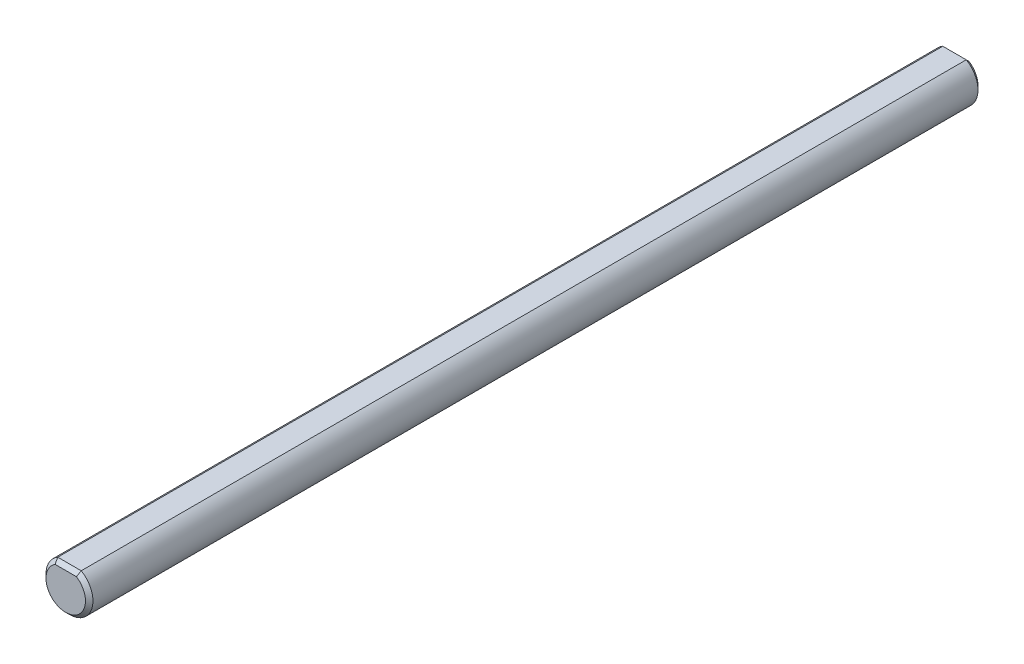
ISO-10303-21;
HEADER;
FILE_DESCRIPTION(('STEP AP214'),'2;1');
FILE_NAME('part.step','',(''),(''),'','','');
FILE_SCHEMA(('AUTOMOTIVE_DESIGN { 1 0 10303 214 1 1 1 1 }'));
ENDSEC;
DATA;
#1=APPLICATION_CONTEXT('core data for automotive mechanical design processes');
#2=APPLICATION_PROTOCOL_DEFINITION('international standard','automotive_design',2000,#1);
#3=PRODUCT_CONTEXT('',#1,'mechanical');
#4=PRODUCT('Part','Part','',(#3));
#5=PRODUCT_RELATED_PRODUCT_CATEGORY('part','',(#4));
#6=PRODUCT_DEFINITION_FORMATION('','',#4);
#7=PRODUCT_DEFINITION_CONTEXT('part definition',#1,'design');
#8=PRODUCT_DEFINITION('design','',#6,#7);
#9=PRODUCT_DEFINITION_SHAPE('','',#8);
#10=(LENGTH_UNIT() NAMED_UNIT(*) SI_UNIT(.MILLI.,.METRE.));
#11=(NAMED_UNIT(*) PLANE_ANGLE_UNIT() SI_UNIT($,.RADIAN.));
#12=(NAMED_UNIT(*) SI_UNIT($,.STERADIAN.) SOLID_ANGLE_UNIT());
#13=UNCERTAINTY_MEASURE_WITH_UNIT(LENGTH_MEASURE(1.E-05),#10,'distance_accuracy_value','');
#14=(GEOMETRIC_REPRESENTATION_CONTEXT(3) GLOBAL_UNCERTAINTY_ASSIGNED_CONTEXT((#13)) GLOBAL_UNIT_ASSIGNED_CONTEXT((#10,
#11,#12)) REPRESENTATION_CONTEXT('',''));
#15=CARTESIAN_POINT('',(0.,0.,0.));
#16=DIRECTION('',(0.,0.,1.));
#17=DIRECTION('',(1.,0.,0.));
#18=AXIS2_PLACEMENT_3D('',#15,#16,#17);
#19=CARTESIAN_POINT('',(0.,0.,120.65));
#20=DIRECTION('',(0.,0.,-1.));
#21=DIRECTION('',(-1.,0.,0.));
#22=AXIS2_PLACEMENT_3D('',#19,#20,#21);
#23=CYLINDRICAL_SURFACE('',#22,3.175);
#24=DIRECTION('',(0.,0.,-1.));
#25=VECTOR('',#24,1.);
#26=CARTESIAN_POINT('',(1.5875,2.74963065701559,120.65));
#27=LINE('',#26,#25);
#28=CARTESIAN_POINT('',(1.5875,2.74963065701559,120.142));
#29=VERTEX_POINT('',#28);
#30=CARTESIAN_POINT('',(1.5875,2.74963065701559,0.508000000000119));
#31=VERTEX_POINT('',#30);
#32=EDGE_CURVE('E100',#29,#31,#27,.T.);
#33=ORIENTED_EDGE('',*,*,#32,.F.);
#34=CARTESIAN_POINT('',(0.,0.,120.142));
#35=DIRECTION('',(0.,0.,1.));
#36=DIRECTION('',(1.,0.,0.));
#37=AXIS2_PLACEMENT_3D('',#34,#35,#36);
#38=CIRCLE('',#37,3.175);
#39=CARTESIAN_POINT('',(-1.5875,2.74963065701559,120.142));
#40=VERTEX_POINT('',#39);
#41=EDGE_CURVE('E112',#29,#40,#38,.F.);
#42=ORIENTED_EDGE('',*,*,#41,.T.);
#43=DIRECTION('',(0.,0.,-1.));
#44=VECTOR('',#43,1.);
#45=CARTESIAN_POINT('',(-1.5875,2.74963065701559,120.65));
#46=LINE('',#45,#44);
#47=CARTESIAN_POINT('',(-1.5875,2.74963065701559,0.508000000000119));
#48=VERTEX_POINT('',#47);
#49=EDGE_CURVE('E156',#40,#48,#46,.T.);
#50=ORIENTED_EDGE('',*,*,#49,.T.);
#51=CARTESIAN_POINT('',(0.,0.,0.508000000000092));
#52=DIRECTION('',(0.,0.,1.));
#53=DIRECTION('',(1.,0.,0.));
#54=AXIS2_PLACEMENT_3D('',#51,#52,#53);
#55=CIRCLE('',#54,3.175);
#56=EDGE_CURVE('E110',#48,#31,#55,.T.);
#57=ORIENTED_EDGE('',*,*,#56,.T.);
#58=EDGE_LOOP('',(#33,#42,#50,#57));
#59=FACE_BOUND('',#58,.T.);
#60=ADVANCED_FACE('F37',(#59),#23,.T.);
#61=CARTESIAN_POINT('',(-1.5875,2.74963065701559,120.65));
#62=DIRECTION('',(0.,-1.,0.));
#63=DIRECTION('',(0.,0.,-1.));
#64=AXIS2_PLACEMENT_3D('',#61,#62,#63);
#65=PLANE('',#64);
#66=ORIENTED_EDGE('',*,*,#49,.F.);
#67=DIRECTION('',(1.,0.,0.));
#68=VECTOR('',#67,1.);
#69=CARTESIAN_POINT('',(1.5875,2.74963065701559,120.142));
#70=LINE('',#69,#68);
#71=EDGE_CURVE('E91',#40,#29,#70,.T.);
#72=ORIENTED_EDGE('',*,*,#71,.T.);
#73=ORIENTED_EDGE('',*,*,#32,.T.);
#74=DIRECTION('',(-1.,0.,0.));
#75=VECTOR('',#74,1.);
#76=CARTESIAN_POINT('',(-1.5875,2.74963065701559,0.508000000000106));
#77=LINE('',#76,#75);
#78=EDGE_CURVE('E103',#31,#48,#77,.T.);
#79=ORIENTED_EDGE('',*,*,#78,.T.);
#80=EDGE_LOOP('',(#66,#72,#73,#79));
#81=FACE_BOUND('',#80,.T.);
#82=ADVANCED_FACE('F155',(#81),#65,.F.);
#83=CARTESIAN_POINT('',(0.,0.,120.65));
#84=DIRECTION('',(0.,0.,1.));
#85=DIRECTION('',(1.,0.,0.));
#86=AXIS2_PLACEMENT_3D('',#83,#84,#85);
#87=PLANE('',#86);
#88=CARTESIAN_POINT('',(0.,0.,120.65));
#89=DIRECTION('',(0.,0.,1.));
#90=DIRECTION('',(1.,0.,0.));
#91=AXIS2_PLACEMENT_3D('',#88,#89,#90);
#92=CIRCLE('',#91,2.66700000000007);
#93=CARTESIAN_POINT('',(-1.44498477415089,2.24163065701566,120.65));
#94=VERTEX_POINT('',#93);
#95=CARTESIAN_POINT('',(1.44498477415089,2.24163065701566,120.65));
#96=VERTEX_POINT('',#95);
#97=EDGE_CURVE('E97',#94,#96,#92,.T.);
#98=ORIENTED_EDGE('',*,*,#97,.T.);
#99=DIRECTION('',(-1.,0.,0.));
#100=VECTOR('',#99,1.);
#101=CARTESIAN_POINT('',(-1.5875,2.24163065701566,120.65));
#102=LINE('',#101,#100);
#103=EDGE_CURVE('E89',#96,#94,#102,.T.);
#104=ORIENTED_EDGE('',*,*,#103,.T.);
#105=EDGE_LOOP('',(#98,#104));
#106=FACE_BOUND('',#105,.T.);
#107=ADVANCED_FACE('F102',(#106),#87,.T.);
#108=CARTESIAN_POINT('',(0.,0.,0.));
#109=DIRECTION('',(0.,0.,1.));
#110=DIRECTION('',(1.,0.,0.));
#111=AXIS2_PLACEMENT_3D('',#108,#109,#110);
#112=PLANE('',#111);
#113=CARTESIAN_POINT('',(0.,0.,0.));
#114=DIRECTION('',(0.,0.,1.));
#115=DIRECTION('',(1.,0.,0.));
#116=AXIS2_PLACEMENT_3D('',#113,#114,#115);
#117=CIRCLE('',#116,2.66699999999991);
#118=CARTESIAN_POINT('',(1.44498477415084,2.2416306570155,0.));
#119=VERTEX_POINT('',#118);
#120=CARTESIAN_POINT('',(-1.44498477415084,2.2416306570155,0.));
#121=VERTEX_POINT('',#120);
#122=EDGE_CURVE('E52',#119,#121,#117,.F.);
#123=ORIENTED_EDGE('',*,*,#122,.T.);
#124=DIRECTION('',(1.,0.,0.));
#125=VECTOR('',#124,1.);
#126=CARTESIAN_POINT('',(0.,2.2416306570155,0.));
#127=LINE('',#126,#125);
#128=EDGE_CURVE('E11',#121,#119,#127,.T.);
#129=ORIENTED_EDGE('',*,*,#128,.T.);
#130=EDGE_LOOP('',(#123,#129));
#131=FACE_BOUND('',#130,.T.);
#132=ADVANCED_FACE('F164',(#131),#112,.F.);
#133=CARTESIAN_POINT('',(0.,0.,120.65));
#134=DIRECTION('',(0.,0.,-1.));
#135=DIRECTION('',(-1.,0.,0.));
#136=AXIS2_PLACEMENT_3D('',#133,#134,#135);
#137=CONICAL_SURFACE('',#136,2.66700000000007,0.785398163397438);
#138=CARTESIAN_POINT('',(-1.44498477415089,2.24163065701566,120.65));
#139=CARTESIAN_POINT('',(-1.46981082100592,2.32614689549515,120.565483761521));
#140=CARTESIAN_POINT('',(-1.49410013308599,2.41073842223696,120.480892234779));
#141=CARTESIAN_POINT('',(-1.54160520461425,2.58007175609696,120.311558900919));
#142=CARTESIAN_POINT('',(-1.56482096781721,2.66481356268845,120.226817094327));
#143=CARTESIAN_POINT('',(-1.5875,2.74963065701559,120.142));
#144=B_SPLINE_CURVE_WITH_KNOTS('',3,(#138,#139,#140,#141,#142,#143),.UNSPECIFIED.,.F.,.F.,(4,2,
4),(0.,0.366214160388582,0.732427039830156),.UNSPECIFIED.);
#145=EDGE_CURVE('E85',#40,#94,#144,.F.);
#146=ORIENTED_EDGE('',*,*,#145,.F.);
#147=ORIENTED_EDGE('',*,*,#41,.F.);
#148=CARTESIAN_POINT('',(1.5875,2.74963065701559,120.142));
#149=CARTESIAN_POINT('',(1.56482096781721,2.66481356268845,120.226817094327));
#150=CARTESIAN_POINT('',(1.54160520461425,2.58007175609696,120.311558900919));
#151=CARTESIAN_POINT('',(1.49410013308599,2.41073842223696,120.480892234779));
#152=CARTESIAN_POINT('',(1.46981082100592,2.32614689549514,120.56548376152));
#153=CARTESIAN_POINT('',(1.44498477415089,2.24163065701566,120.65));
#154=B_SPLINE_CURVE_WITH_KNOTS('',3,(#148,#149,#150,#151,#152,#153),.UNSPECIFIED.,.F.,.F.,(4,2,
4),(0.,0.366212879441566,0.732427039830159),.UNSPECIFIED.);
#155=EDGE_CURVE('E94',#96,#29,#154,.F.);
#156=ORIENTED_EDGE('',*,*,#155,.F.);
#157=ORIENTED_EDGE('',*,*,#97,.F.);
#158=EDGE_LOOP('',(#146,#147,#156,#157));
#159=FACE_BOUND('',#158,.T.);
#160=ADVANCED_FACE('F98',(#159),#137,.T.);
#161=CARTESIAN_POINT('',(0.,2.24163065701566,120.65));
#162=DIRECTION('',(0.,0.707106781186555,0.70710678118654));
#163=DIRECTION('',(1.,0.,0.));
#164=AXIS2_PLACEMENT_3D('',#161,#162,#163);
#165=PLANE('',#164);
#166=ORIENTED_EDGE('',*,*,#155,.T.);
#167=ORIENTED_EDGE('',*,*,#71,.F.);
#168=ORIENTED_EDGE('',*,*,#145,.T.);
#169=ORIENTED_EDGE('',*,*,#103,.F.);
#170=EDGE_LOOP('',(#166,#167,#168,#169));
#171=FACE_BOUND('',#170,.T.);
#172=ADVANCED_FACE('F87',(#171),#165,.T.);
#173=CARTESIAN_POINT('',(0.,0.,0.508000000000092));
#174=DIRECTION('',(0.,0.,1.));
#175=DIRECTION('',(1.,0.,0.));
#176=AXIS2_PLACEMENT_3D('',#173,#174,#175);
#177=CONICAL_SURFACE('',#176,3.175,0.785398163397451);
#178=CARTESIAN_POINT('',(-1.5875,2.74963065701559,0.508000000000119));
#179=CARTESIAN_POINT('',(-1.56482096781721,2.66481356268843,0.423182905672945));
#180=CARTESIAN_POINT('',(-1.54160520461425,2.58007175609691,0.338441099081421));
#181=CARTESIAN_POINT('',(-1.49410013308598,2.41073842223686,0.169107765221361));
#182=CARTESIAN_POINT('',(-1.46981082100589,2.32614689549501,0.084516238479512));
#183=CARTESIAN_POINT('',(-1.44498477415084,2.2416306570155,0.));
#184=B_SPLINE_CURVE_WITH_KNOTS('',3,(#178,#179,#180,#181,#182,#183),.UNSPECIFIED.,.F.,.F.,(4,2,
4),(0.,0.366212879441686,0.732427039830408),.UNSPECIFIED.);
#185=EDGE_CURVE('E142',#121,#48,#184,.F.);
#186=ORIENTED_EDGE('',*,*,#185,.F.);
#187=ORIENTED_EDGE('',*,*,#122,.F.);
#188=CARTESIAN_POINT('',(1.44498477415084,2.2416306570155,0.));
#189=CARTESIAN_POINT('',(1.46981082100589,2.32614689549501,0.0845162384795138));
#190=CARTESIAN_POINT('',(1.49410013308597,2.41073842223686,0.169107765221363));
#191=CARTESIAN_POINT('',(1.54160520461425,2.58007175609691,0.338441099081419));
#192=CARTESIAN_POINT('',(1.56482096781723,2.66481356268843,0.423182905672939));
#193=CARTESIAN_POINT('',(1.58750000000003,2.7496306570156,0.508000000000108));
#194=B_SPLINE_CURVE_WITH_KNOTS('',3,(#188,#189,#190,#191,#192,#193),.UNSPECIFIED.,.F.,.F.,(4,2,
4),(0.,0.366214160388722,0.732427039830408),.UNSPECIFIED.);
#195=EDGE_CURVE('E43',#31,#119,#194,.F.);
#196=ORIENTED_EDGE('',*,*,#195,.F.);
#197=ORIENTED_EDGE('',*,*,#56,.F.);
#198=EDGE_LOOP('',(#186,#187,#196,#197));
#199=FACE_BOUND('',#198,.T.);
#200=ADVANCED_FACE('F133',(#199),#177,.T.);
#201=CARTESIAN_POINT('',(-1.5875,2.74963065701559,0.508000000000106));
#202=DIRECTION('',(0.,-0.707106781186555,0.70710678118654));
#203=DIRECTION('',(-1.,0.,0.));
#204=AXIS2_PLACEMENT_3D('',#201,#202,#203);
#205=PLANE('',#204);
#206=ORIENTED_EDGE('',*,*,#195,.T.);
#207=ORIENTED_EDGE('',*,*,#128,.F.);
#208=ORIENTED_EDGE('',*,*,#185,.T.);
#209=ORIENTED_EDGE('',*,*,#78,.F.);
#210=EDGE_LOOP('',(#206,#207,#208,#209));
#211=FACE_BOUND('',#210,.T.);
#212=ADVANCED_FACE('F40',(#211),#205,.F.);
#213=CLOSED_SHELL('',(#60,#82,#107,#132,#160,#172,#200,#212));
#214=MANIFOLD_SOLID_BREP('B2',#213);
#215=ADVANCED_BREP_SHAPE_REPRESENTATION('',(#18,#214),#14);
#216=SHAPE_DEFINITION_REPRESENTATION(#9,#215);
ENDSEC;
END-ISO-10303-21;
